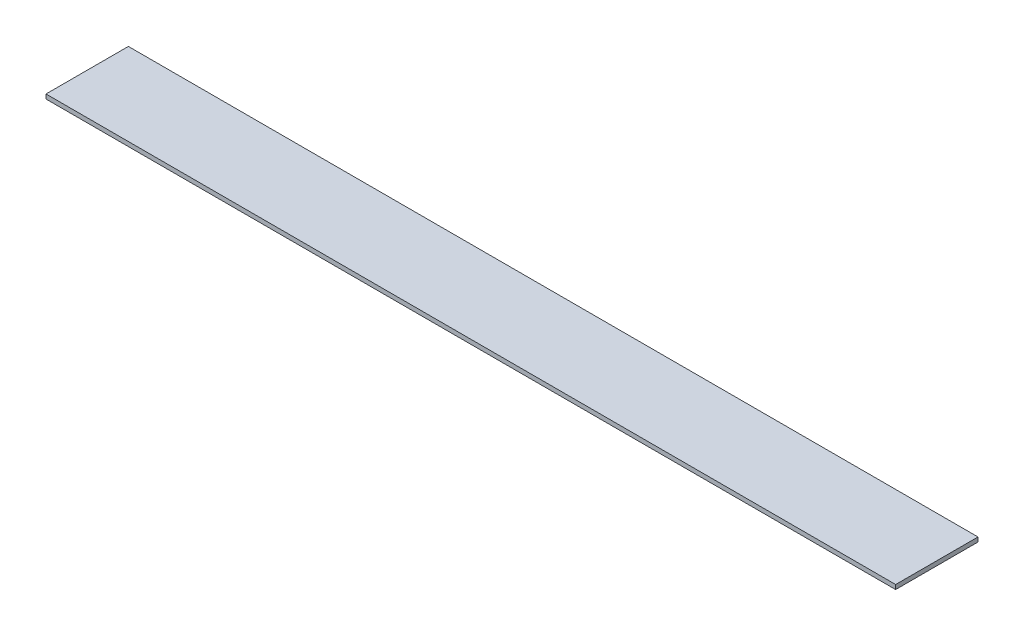
ISO-10303-21;
HEADER;
FILE_DESCRIPTION(('STEP AP214'),'2;1');
FILE_NAME('part.step','',(''),(''),'','','');
FILE_SCHEMA(('AUTOMOTIVE_DESIGN { 1 0 10303 214 1 1 1 1 }'));
ENDSEC;
DATA;
#1=APPLICATION_CONTEXT('core data for automotive mechanical design processes');
#2=APPLICATION_PROTOCOL_DEFINITION('international standard','automotive_design',2000,#1);
#3=PRODUCT_CONTEXT('',#1,'mechanical');
#4=PRODUCT('Part','Part','',(#3));
#5=PRODUCT_RELATED_PRODUCT_CATEGORY('part','',(#4));
#6=PRODUCT_DEFINITION_FORMATION('','',#4);
#7=PRODUCT_DEFINITION_CONTEXT('part definition',#1,'design');
#8=PRODUCT_DEFINITION('design','',#6,#7);
#9=PRODUCT_DEFINITION_SHAPE('','',#8);
#10=(LENGTH_UNIT() NAMED_UNIT(*) SI_UNIT(.MILLI.,.METRE.));
#11=(NAMED_UNIT(*) PLANE_ANGLE_UNIT() SI_UNIT($,.RADIAN.));
#12=(NAMED_UNIT(*) SI_UNIT($,.STERADIAN.) SOLID_ANGLE_UNIT());
#13=UNCERTAINTY_MEASURE_WITH_UNIT(LENGTH_MEASURE(1.E-05),#10,'distance_accuracy_value','');
#14=(GEOMETRIC_REPRESENTATION_CONTEXT(3) GLOBAL_UNCERTAINTY_ASSIGNED_CONTEXT((#13)) GLOBAL_UNIT_ASSIGNED_CONTEXT((#10,
#11,#12)) REPRESENTATION_CONTEXT('',''));
#15=CARTESIAN_POINT('',(0.,0.,0.));
#16=DIRECTION('',(0.,0.,1.));
#17=DIRECTION('',(1.,0.,0.));
#18=AXIS2_PLACEMENT_3D('',#15,#16,#17);
#19=CARTESIAN_POINT('',(0.,3.175,0.));
#20=DIRECTION('',(0.,0.,-1.));
#21=DIRECTION('',(-1.,0.,0.));
#22=AXIS2_PLACEMENT_3D('',#19,#20,#21);
#23=PLANE('',#22);
#24=DIRECTION('',(1.,0.,0.));
#25=VECTOR('',#24,1.);
#26=CARTESIAN_POINT('',(0.,0.,0.));
#27=LINE('',#26,#25);
#28=CARTESIAN_POINT('',(0.,0.,0.));
#29=VERTEX_POINT('',#28);
#30=CARTESIAN_POINT('',(612.775,0.,0.));
#31=VERTEX_POINT('',#30);
#32=EDGE_CURVE('E95',#29,#31,#27,.T.);
#33=ORIENTED_EDGE('',*,*,#32,.T.);
#34=DIRECTION('',(0.,-1.,0.));
#35=VECTOR('',#34,1.);
#36=CARTESIAN_POINT('',(612.775,3.175,0.));
#37=LINE('',#36,#35);
#38=CARTESIAN_POINT('',(612.775,3.175,0.));
#39=VERTEX_POINT('',#38);
#40=EDGE_CURVE('E11',#39,#31,#37,.T.);
#41=ORIENTED_EDGE('',*,*,#40,.F.);
#42=DIRECTION('',(1.,0.,0.));
#43=VECTOR('',#42,1.);
#44=CARTESIAN_POINT('',(0.,3.175,0.));
#45=LINE('',#44,#43);
#46=CARTESIAN_POINT('',(0.,3.175,0.));
#47=VERTEX_POINT('',#46);
#48=EDGE_CURVE('E81',#47,#39,#45,.T.);
#49=ORIENTED_EDGE('',*,*,#48,.F.);
#50=DIRECTION('',(0.,-1.,0.));
#51=VECTOR('',#50,1.);
#52=CARTESIAN_POINT('',(0.,3.175,0.));
#53=LINE('',#52,#51);
#54=EDGE_CURVE('E48',#47,#29,#53,.T.);
#55=ORIENTED_EDGE('',*,*,#54,.T.);
#56=EDGE_LOOP('',(#33,#41,#49,#55));
#57=FACE_BOUND('',#56,.T.);
#58=ADVANCED_FACE('F32',(#57),#23,.F.);
#59=CARTESIAN_POINT('',(612.775,3.175,0.));
#60=DIRECTION('',(-1.,0.,0.));
#61=DIRECTION('',(0.,0.,1.));
#62=AXIS2_PLACEMENT_3D('',#59,#60,#61);
#63=PLANE('',#62);
#64=DIRECTION('',(0.,0.,-1.));
#65=VECTOR('',#64,1.);
#66=CARTESIAN_POINT('',(612.775,0.,0.));
#67=LINE('',#66,#65);
#68=CARTESIAN_POINT('',(612.775,0.,-59.4));
#69=VERTEX_POINT('',#68);
#70=EDGE_CURVE('E86',#31,#69,#67,.T.);
#71=ORIENTED_EDGE('',*,*,#70,.T.);
#72=DIRECTION('',(0.,-1.,0.));
#73=VECTOR('',#72,1.);
#74=CARTESIAN_POINT('',(612.775,3.175,-59.4));
#75=LINE('',#74,#73);
#76=CARTESIAN_POINT('',(612.775,3.175,-59.4));
#77=VERTEX_POINT('',#76);
#78=EDGE_CURVE('E40',#77,#69,#75,.T.);
#79=ORIENTED_EDGE('',*,*,#78,.F.);
#80=DIRECTION('',(0.,0.,-1.));
#81=VECTOR('',#80,1.);
#82=CARTESIAN_POINT('',(612.775,3.175,0.));
#83=LINE('',#82,#81);
#84=EDGE_CURVE('E73',#39,#77,#83,.T.);
#85=ORIENTED_EDGE('',*,*,#84,.F.);
#86=ORIENTED_EDGE('',*,*,#40,.T.);
#87=EDGE_LOOP('',(#71,#79,#85,#86));
#88=FACE_BOUND('',#87,.T.);
#89=ADVANCED_FACE('F85',(#88),#63,.F.);
#90=CARTESIAN_POINT('',(0.,3.175,-59.4));
#91=DIRECTION('',(0.,0.,-1.));
#92=DIRECTION('',(-1.,0.,0.));
#93=AXIS2_PLACEMENT_3D('',#90,#91,#92);
#94=PLANE('',#93);
#95=DIRECTION('',(1.,0.,0.));
#96=VECTOR('',#95,1.);
#97=CARTESIAN_POINT('',(0.,0.,-59.4));
#98=LINE('',#97,#96);
#99=CARTESIAN_POINT('',(0.,0.,-59.4));
#100=VERTEX_POINT('',#99);
#101=EDGE_CURVE('E98',#100,#69,#98,.T.);
#102=ORIENTED_EDGE('',*,*,#101,.F.);
#103=DIRECTION('',(0.,-1.,0.));
#104=VECTOR('',#103,1.);
#105=CARTESIAN_POINT('',(0.,3.175,-59.4));
#106=LINE('',#105,#104);
#107=CARTESIAN_POINT('',(0.,3.175,-59.4));
#108=VERTEX_POINT('',#107);
#109=EDGE_CURVE('E62',#108,#100,#106,.T.);
#110=ORIENTED_EDGE('',*,*,#109,.F.);
#111=DIRECTION('',(1.,0.,0.));
#112=VECTOR('',#111,1.);
#113=CARTESIAN_POINT('',(0.,3.175,-59.4));
#114=LINE('',#113,#112);
#115=EDGE_CURVE('E80',#108,#77,#114,.T.);
#116=ORIENTED_EDGE('',*,*,#115,.T.);
#117=ORIENTED_EDGE('',*,*,#78,.T.);
#118=EDGE_LOOP('',(#102,#110,#116,#117));
#119=FACE_BOUND('',#118,.T.);
#120=ADVANCED_FACE('F89',(#119),#94,.T.);
#121=CARTESIAN_POINT('',(0.,3.175,0.));
#122=DIRECTION('',(-1.,0.,0.));
#123=DIRECTION('',(0.,0.,1.));
#124=AXIS2_PLACEMENT_3D('',#121,#122,#123);
#125=PLANE('',#124);
#126=DIRECTION('',(0.,0.,-1.));
#127=VECTOR('',#126,1.);
#128=CARTESIAN_POINT('',(0.,0.,0.));
#129=LINE('',#128,#127);
#130=EDGE_CURVE('E100',#29,#100,#129,.T.);
#131=ORIENTED_EDGE('',*,*,#130,.F.);
#132=ORIENTED_EDGE('',*,*,#54,.F.);
#133=DIRECTION('',(0.,0.,-1.));
#134=VECTOR('',#133,1.);
#135=CARTESIAN_POINT('',(0.,3.175,0.));
#136=LINE('',#135,#134);
#137=EDGE_CURVE('E90',#47,#108,#136,.T.);
#138=ORIENTED_EDGE('',*,*,#137,.T.);
#139=ORIENTED_EDGE('',*,*,#109,.T.);
#140=EDGE_LOOP('',(#131,#132,#138,#139));
#141=FACE_BOUND('',#140,.T.);
#142=ADVANCED_FACE('F106',(#141),#125,.T.);
#143=CARTESIAN_POINT('',(0.,3.175,0.));
#144=DIRECTION('',(0.,1.,0.));
#145=DIRECTION('',(0.,0.,1.));
#146=AXIS2_PLACEMENT_3D('',#143,#144,#145);
#147=PLANE('',#146);
#148=ORIENTED_EDGE('',*,*,#48,.T.);
#149=ORIENTED_EDGE('',*,*,#84,.T.);
#150=ORIENTED_EDGE('',*,*,#115,.F.);
#151=ORIENTED_EDGE('',*,*,#137,.F.);
#152=EDGE_LOOP('',(#148,#149,#150,#151));
#153=FACE_BOUND('',#152,.T.);
#154=ADVANCED_FACE('F77',(#153),#147,.T.);
#155=CARTESIAN_POINT('',(0.,0.,0.));
#156=DIRECTION('',(0.,1.,0.));
#157=DIRECTION('',(0.,0.,1.));
#158=AXIS2_PLACEMENT_3D('',#155,#156,#157);
#159=PLANE('',#158);
#160=ORIENTED_EDGE('',*,*,#32,.F.);
#161=ORIENTED_EDGE('',*,*,#130,.T.);
#162=ORIENTED_EDGE('',*,*,#101,.T.);
#163=ORIENTED_EDGE('',*,*,#70,.F.);
#164=EDGE_LOOP('',(#160,#161,#162,#163));
#165=FACE_BOUND('',#164,.T.);
#166=ADVANCED_FACE('F105',(#165),#159,.F.);
#167=CLOSED_SHELL('',(#58,#89,#120,#142,#154,#166));
#168=MANIFOLD_SOLID_BREP('B2',#167);
#169=ADVANCED_BREP_SHAPE_REPRESENTATION('',(#18,#168),#14);
#170=SHAPE_DEFINITION_REPRESENTATION(#9,#169);
ENDSEC;
END-ISO-10303-21;
